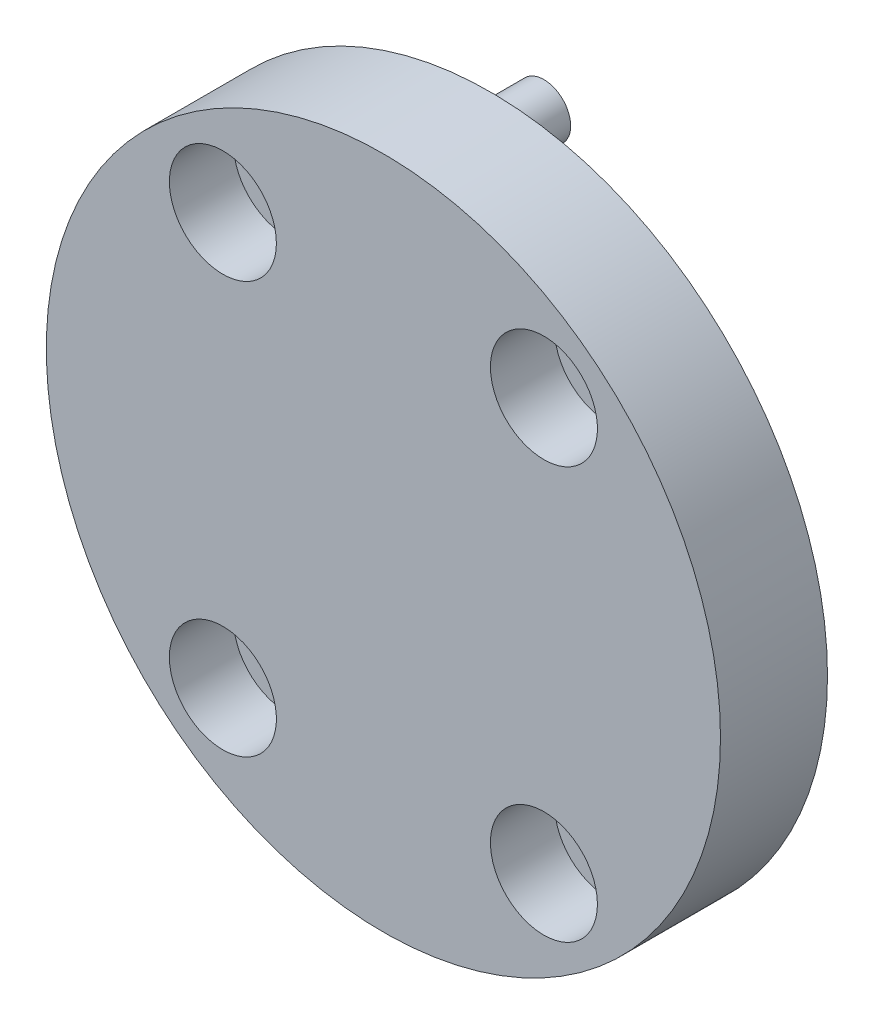
ISO-10303-21;
HEADER;
FILE_DESCRIPTION(('STEP AP214'),'2;1');
FILE_NAME('part.step','',(''),(''),'','','');
FILE_SCHEMA(('AUTOMOTIVE_DESIGN { 1 0 10303 214 1 1 1 1 }'));
ENDSEC;
DATA;
#1=APPLICATION_CONTEXT('core data for automotive mechanical design processes');
#2=APPLICATION_PROTOCOL_DEFINITION('international standard','automotive_design',2000,#1);
#3=PRODUCT_CONTEXT('',#1,'mechanical');
#4=PRODUCT('Part','Part','',(#3));
#5=PRODUCT_RELATED_PRODUCT_CATEGORY('part','',(#4));
#6=PRODUCT_DEFINITION_FORMATION('','',#4);
#7=PRODUCT_DEFINITION_CONTEXT('part definition',#1,'design');
#8=PRODUCT_DEFINITION('design','',#6,#7);
#9=PRODUCT_DEFINITION_SHAPE('','',#8);
#10=(LENGTH_UNIT() NAMED_UNIT(*) SI_UNIT(.MILLI.,.METRE.));
#11=(NAMED_UNIT(*) PLANE_ANGLE_UNIT() SI_UNIT($,.RADIAN.));
#12=(NAMED_UNIT(*) SI_UNIT($,.STERADIAN.) SOLID_ANGLE_UNIT());
#13=UNCERTAINTY_MEASURE_WITH_UNIT(LENGTH_MEASURE(1.E-05),#10,'distance_accuracy_value','');
#14=(GEOMETRIC_REPRESENTATION_CONTEXT(3) GLOBAL_UNCERTAINTY_ASSIGNED_CONTEXT((#13)) GLOBAL_UNIT_ASSIGNED_CONTEXT((#10,
#11,#12)) REPRESENTATION_CONTEXT('',''));
#15=CARTESIAN_POINT('',(0.,0.,0.));
#16=DIRECTION('',(0.,0.,1.));
#17=DIRECTION('',(1.,0.,0.));
#18=AXIS2_PLACEMENT_3D('',#15,#16,#17);
#19=CARTESIAN_POINT('',(0.,0.,5.));
#20=DIRECTION('',(0.,0.,1.));
#21=DIRECTION('',(1.,0.,0.));
#22=AXIS2_PLACEMENT_3D('',#19,#20,#21);
#23=PLANE('',#22);
#24=CARTESIAN_POINT('',(-15.,-19.2426406871192,5.));
#25=DIRECTION('',(0.,0.,-1.));
#26=DIRECTION('',(-1.,0.,0.));
#27=AXIS2_PLACEMENT_3D('',#24,#25,#26);
#28=CIRCLE('',#27,4.99999999999999);
#29=CARTESIAN_POINT('',(-20.,-19.2426406871192,5.));
#30=VERTEX_POINT('',#29);
#31=EDGE_CURVE('E203',#30,#30,#28,.T.);
#32=ORIENTED_EDGE('',*,*,#31,.T.);
#33=EDGE_LOOP('',(#32));
#34=FACE_BOUND('',#33,.T.);
#35=CARTESIAN_POINT('',(15.,-19.2426406871192,5.));
#36=DIRECTION('',(0.,0.,1.));
#37=DIRECTION('',(1.,0.,0.));
#38=AXIS2_PLACEMENT_3D('',#35,#36,#37);
#39=CIRCLE('',#38,4.99999999999999);
#40=CARTESIAN_POINT('',(20.,-19.2426406871192,5.));
#41=VERTEX_POINT('',#40);
#42=EDGE_CURVE('E214',#41,#41,#39,.T.);
#43=ORIENTED_EDGE('',*,*,#42,.F.);
#44=EDGE_LOOP('',(#43));
#45=FACE_BOUND('',#44,.T.);
#46=CARTESIAN_POINT('',(-15.,19.2426406871192,5.));
#47=DIRECTION('',(0.,0.,1.));
#48=DIRECTION('',(1.,0.,0.));
#49=AXIS2_PLACEMENT_3D('',#46,#47,#48);
#50=CIRCLE('',#49,5.);
#51=CARTESIAN_POINT('',(-10.,19.2426406871192,5.));
#52=VERTEX_POINT('',#51);
#53=EDGE_CURVE('E87',#52,#52,#50,.T.);
#54=ORIENTED_EDGE('',*,*,#53,.F.);
#55=EDGE_LOOP('',(#54));
#56=FACE_BOUND('',#55,.T.);
#57=CARTESIAN_POINT('',(0.,0.,5.));
#58=DIRECTION('',(0.,0.,1.));
#59=DIRECTION('',(1.,0.,0.));
#60=AXIS2_PLACEMENT_3D('',#57,#58,#59);
#61=CIRCLE('',#60,31.5);
#62=CARTESIAN_POINT('',(31.5,0.,5.));
#63=VERTEX_POINT('',#62);
#64=EDGE_CURVE('E10',#63,#63,#61,.T.);
#65=ORIENTED_EDGE('',*,*,#64,.T.);
#66=EDGE_LOOP('',(#65));
#67=FACE_BOUND('',#66,.T.);
#68=CARTESIAN_POINT('',(15.,19.2426406871192,5.));
#69=DIRECTION('',(0.,0.,-1.));
#70=DIRECTION('',(-1.,0.,0.));
#71=AXIS2_PLACEMENT_3D('',#68,#69,#70);
#72=CIRCLE('',#71,5.);
#73=CARTESIAN_POINT('',(10.,19.2426406871192,5.));
#74=VERTEX_POINT('',#73);
#75=EDGE_CURVE('E196',#74,#74,#72,.T.);
#76=ORIENTED_EDGE('',*,*,#75,.T.);
#77=EDGE_LOOP('',(#76));
#78=FACE_BOUND('',#77,.T.);
#79=ADVANCED_FACE('F37',(#34,#45,#56,#67,#78),#23,.T.);
#80=CARTESIAN_POINT('',(-15.,19.2426406871192,-5.));
#81=DIRECTION('',(0.,0.,1.));
#82=DIRECTION('',(1.,0.,0.));
#83=AXIS2_PLACEMENT_3D('',#80,#81,#82);
#84=CYLINDRICAL_SURFACE('',#83,3.);
#85=CARTESIAN_POINT('',(-15.,19.2426406871192,-5.));
#86=DIRECTION('',(0.,0.,1.));
#87=DIRECTION('',(1.,0.,0.));
#88=AXIS2_PLACEMENT_3D('',#85,#86,#87);
#89=CIRCLE('',#88,3.);
#90=CARTESIAN_POINT('',(-12.,19.2426406871192,-5.));
#91=VERTEX_POINT('',#90);
#92=EDGE_CURVE('E89',#91,#91,#89,.T.);
#93=ORIENTED_EDGE('',*,*,#92,.F.);
#94=EDGE_LOOP('',(#93));
#95=FACE_BOUND('',#94,.T.);
#96=CARTESIAN_POINT('',(-15.,19.2426406871192,-1.));
#97=DIRECTION('',(0.,0.,1.));
#98=DIRECTION('',(1.,0.,0.));
#99=AXIS2_PLACEMENT_3D('',#96,#97,#98);
#100=CIRCLE('',#99,3.);
#101=CARTESIAN_POINT('',(-12.,19.2426406871192,-1.));
#102=VERTEX_POINT('',#101);
#103=EDGE_CURVE('E71',#102,#102,#100,.F.);
#104=ORIENTED_EDGE('',*,*,#103,.F.);
#105=EDGE_LOOP('',(#104));
#106=FACE_BOUND('',#105,.T.);
#107=ADVANCED_FACE('F105',(#95,#106),#84,.F.);
#108=CARTESIAN_POINT('',(15.,-19.2426406871192,-5.));
#109=DIRECTION('',(0.,0.,1.));
#110=DIRECTION('',(1.,0.,0.));
#111=AXIS2_PLACEMENT_3D('',#108,#109,#110);
#112=CYLINDRICAL_SURFACE('',#111,3.);
#113=CARTESIAN_POINT('',(15.,-19.2426406871192,-5.));
#114=DIRECTION('',(0.,0.,1.));
#115=DIRECTION('',(1.,0.,0.));
#116=AXIS2_PLACEMENT_3D('',#113,#114,#115);
#117=CIRCLE('',#116,3.);
#118=CARTESIAN_POINT('',(18.,-19.2426406871192,-5.));
#119=VERTEX_POINT('',#118);
#120=EDGE_CURVE('E61',#119,#119,#117,.T.);
#121=ORIENTED_EDGE('',*,*,#120,.F.);
#122=EDGE_LOOP('',(#121));
#123=FACE_BOUND('',#122,.T.);
#124=CARTESIAN_POINT('',(15.,-19.2426406871192,-1.));
#125=DIRECTION('',(0.,0.,1.));
#126=DIRECTION('',(1.,0.,0.));
#127=AXIS2_PLACEMENT_3D('',#124,#125,#126);
#128=CIRCLE('',#127,3.);
#129=CARTESIAN_POINT('',(18.,-19.2426406871192,-1.));
#130=VERTEX_POINT('',#129);
#131=EDGE_CURVE('E63',#130,#130,#128,.F.);
#132=ORIENTED_EDGE('',*,*,#131,.F.);
#133=EDGE_LOOP('',(#132));
#134=FACE_BOUND('',#133,.T.);
#135=ADVANCED_FACE('F102',(#123,#134),#112,.F.);
#136=CARTESIAN_POINT('',(0.,0.,-5.));
#137=DIRECTION('',(0.,0.,1.));
#138=DIRECTION('',(1.,0.,0.));
#139=AXIS2_PLACEMENT_3D('',#136,#137,#138);
#140=PLANE('',#139);
#141=CARTESIAN_POINT('',(0.,27.5,-5.));
#142=DIRECTION('',(0.,0.,1.));
#143=DIRECTION('',(1.,0.,0.));
#144=AXIS2_PLACEMENT_3D('',#141,#142,#143);
#145=CIRCLE('',#144,2.5);
#146=CARTESIAN_POINT('',(2.5,27.5,-5.));
#147=VERTEX_POINT('',#146);
#148=EDGE_CURVE('E57',#147,#147,#145,.T.);
#149=ORIENTED_EDGE('',*,*,#148,.T.);
#150=EDGE_LOOP('',(#149));
#151=FACE_BOUND('',#150,.T.);
#152=ORIENTED_EDGE('',*,*,#92,.T.);
#153=EDGE_LOOP('',(#152));
#154=FACE_BOUND('',#153,.T.);
#155=CARTESIAN_POINT('',(15.,19.2426406871192,-5.));
#156=DIRECTION('',(0.,0.,-1.));
#157=DIRECTION('',(-1.,0.,0.));
#158=AXIS2_PLACEMENT_3D('',#155,#156,#157);
#159=CIRCLE('',#158,3.);
#160=CARTESIAN_POINT('',(12.,19.2426406871192,-5.));
#161=VERTEX_POINT('',#160);
#162=EDGE_CURVE('E52',#161,#161,#159,.T.);
#163=ORIENTED_EDGE('',*,*,#162,.F.);
#164=EDGE_LOOP('',(#163));
#165=FACE_BOUND('',#164,.T.);
#166=CARTESIAN_POINT('',(0.,0.,-5.));
#167=DIRECTION('',(0.,0.,1.));
#168=DIRECTION('',(1.,0.,0.));
#169=AXIS2_PLACEMENT_3D('',#166,#167,#168);
#170=CIRCLE('',#169,31.5);
#171=CARTESIAN_POINT('',(31.5,0.,-5.));
#172=VERTEX_POINT('',#171);
#173=EDGE_CURVE('E46',#172,#172,#170,.T.);
#174=ORIENTED_EDGE('',*,*,#173,.F.);
#175=EDGE_LOOP('',(#174));
#176=FACE_BOUND('',#175,.T.);
#177=CARTESIAN_POINT('',(-15.,-19.2426406871192,-5.));
#178=DIRECTION('',(0.,0.,-1.));
#179=DIRECTION('',(-1.,0.,0.));
#180=AXIS2_PLACEMENT_3D('',#177,#178,#179);
#181=CIRCLE('',#180,3.);
#182=CARTESIAN_POINT('',(-18.,-19.2426406871192,-5.));
#183=VERTEX_POINT('',#182);
#184=EDGE_CURVE('E93',#183,#183,#181,.T.);
#185=ORIENTED_EDGE('',*,*,#184,.F.);
#186=EDGE_LOOP('',(#185));
#187=FACE_BOUND('',#186,.T.);
#188=ORIENTED_EDGE('',*,*,#120,.T.);
#189=EDGE_LOOP('',(#188));
#190=FACE_BOUND('',#189,.T.);
#191=ADVANCED_FACE('F100',(#151,#154,#165,#176,#187,#190),#140,.F.);
#192=CARTESIAN_POINT('',(0.,0.,5.));
#193=DIRECTION('',(0.,0.,-1.));
#194=DIRECTION('',(-1.,0.,0.));
#195=AXIS2_PLACEMENT_3D('',#192,#193,#194);
#196=CYLINDRICAL_SURFACE('',#195,31.5);
#197=ORIENTED_EDGE('',*,*,#64,.F.);
#198=EDGE_LOOP('',(#197));
#199=FACE_BOUND('',#198,.T.);
#200=ORIENTED_EDGE('',*,*,#173,.T.);
#201=EDGE_LOOP('',(#200));
#202=FACE_BOUND('',#201,.T.);
#203=ADVANCED_FACE('F39',(#199,#202),#196,.T.);
#204=CARTESIAN_POINT('',(15.,19.2426406871192,-5.));
#205=DIRECTION('',(0.,0.,1.));
#206=DIRECTION('',(1.,0.,0.));
#207=AXIS2_PLACEMENT_3D('',#204,#205,#206);
#208=CYLINDRICAL_SURFACE('',#207,3.);
#209=CARTESIAN_POINT('',(15.,19.2426406871192,-1.));
#210=DIRECTION('',(0.,0.,-1.));
#211=DIRECTION('',(-1.,0.,0.));
#212=AXIS2_PLACEMENT_3D('',#209,#210,#211);
#213=CIRCLE('',#212,3.);
#214=CARTESIAN_POINT('',(12.,19.2426406871192,-1.));
#215=VERTEX_POINT('',#214);
#216=EDGE_CURVE('E41',#215,#215,#213,.T.);
#217=ORIENTED_EDGE('',*,*,#216,.F.);
#218=EDGE_LOOP('',(#217));
#219=FACE_BOUND('',#218,.T.);
#220=ORIENTED_EDGE('',*,*,#162,.T.);
#221=EDGE_LOOP('',(#220));
#222=FACE_BOUND('',#221,.T.);
#223=ADVANCED_FACE('F138',(#219,#222),#208,.F.);
#224=CARTESIAN_POINT('',(-15.,-19.2426406871192,-5.));
#225=DIRECTION('',(0.,0.,1.));
#226=DIRECTION('',(1.,0.,0.));
#227=AXIS2_PLACEMENT_3D('',#224,#225,#226);
#228=CYLINDRICAL_SURFACE('',#227,3.);
#229=CARTESIAN_POINT('',(-15.,-19.2426406871192,-1.));
#230=DIRECTION('',(0.,0.,-1.));
#231=DIRECTION('',(-1.,0.,0.));
#232=AXIS2_PLACEMENT_3D('',#229,#230,#231);
#233=CIRCLE('',#232,3.);
#234=CARTESIAN_POINT('',(-18.,-19.2426406871192,-1.));
#235=VERTEX_POINT('',#234);
#236=EDGE_CURVE('E67',#235,#235,#233,.T.);
#237=ORIENTED_EDGE('',*,*,#236,.F.);
#238=EDGE_LOOP('',(#237));
#239=FACE_BOUND('',#238,.T.);
#240=ORIENTED_EDGE('',*,*,#184,.T.);
#241=EDGE_LOOP('',(#240));
#242=FACE_BOUND('',#241,.T.);
#243=ADVANCED_FACE('F156',(#239,#242),#228,.F.);
#244=CARTESIAN_POINT('',(0.,27.5,-10.));
#245=DIRECTION('',(0.,0.,1.));
#246=DIRECTION('',(1.,0.,0.));
#247=AXIS2_PLACEMENT_3D('',#244,#245,#246);
#248=CYLINDRICAL_SURFACE('',#247,2.5);
#249=CARTESIAN_POINT('',(0.,27.5,-10.));
#250=DIRECTION('',(0.,0.,1.));
#251=DIRECTION('',(1.,0.,0.));
#252=AXIS2_PLACEMENT_3D('',#249,#250,#251);
#253=CIRCLE('',#252,2.5);
#254=CARTESIAN_POINT('',(2.5,27.5,-10.));
#255=VERTEX_POINT('',#254);
#256=EDGE_CURVE('E62',#255,#255,#253,.T.);
#257=ORIENTED_EDGE('',*,*,#256,.T.);
#258=EDGE_LOOP('',(#257));
#259=FACE_BOUND('',#258,.T.);
#260=ORIENTED_EDGE('',*,*,#148,.F.);
#261=EDGE_LOOP('',(#260));
#262=FACE_BOUND('',#261,.T.);
#263=ADVANCED_FACE('F122',(#259,#262),#248,.T.);
#264=CARTESIAN_POINT('',(0.,27.5,-10.));
#265=DIRECTION('',(0.,0.,1.));
#266=DIRECTION('',(1.,0.,0.));
#267=AXIS2_PLACEMENT_3D('',#264,#265,#266);
#268=PLANE('',#267);
#269=ORIENTED_EDGE('',*,*,#256,.F.);
#270=EDGE_LOOP('',(#269));
#271=FACE_BOUND('',#270,.T.);
#272=ADVANCED_FACE('F112',(#271),#268,.F.);
#273=CARTESIAN_POINT('',(15.,-19.2426406871192,-1.));
#274=DIRECTION('',(0.,0.,1.));
#275=DIRECTION('',(1.,0.,0.));
#276=AXIS2_PLACEMENT_3D('',#273,#274,#275);
#277=PLANE('',#276);
#278=CARTESIAN_POINT('',(15.,-19.2426406871192,-1.));
#279=DIRECTION('',(0.,0.,1.));
#280=DIRECTION('',(1.,0.,0.));
#281=AXIS2_PLACEMENT_3D('',#278,#279,#280);
#282=CIRCLE('',#281,4.99999999999999);
#283=CARTESIAN_POINT('',(20.,-19.2426406871192,-1.));
#284=VERTEX_POINT('',#283);
#285=EDGE_CURVE('E206',#284,#284,#282,.T.);
#286=ORIENTED_EDGE('',*,*,#285,.T.);
#287=EDGE_LOOP('',(#286));
#288=FACE_BOUND('',#287,.T.);
#289=ORIENTED_EDGE('',*,*,#131,.T.);
#290=EDGE_LOOP('',(#289));
#291=FACE_BOUND('',#290,.T.);
#292=ADVANCED_FACE('F109',(#288,#291),#277,.T.);
#293=CARTESIAN_POINT('',(15.,-19.2426406871192,-1.));
#294=DIRECTION('',(0.,0.,1.));
#295=DIRECTION('',(1.,0.,0.));
#296=AXIS2_PLACEMENT_3D('',#293,#294,#295);
#297=CYLINDRICAL_SURFACE('',#296,4.99999999999999);
#298=ORIENTED_EDGE('',*,*,#285,.F.);
#299=EDGE_LOOP('',(#298));
#300=FACE_BOUND('',#299,.T.);
#301=ORIENTED_EDGE('',*,*,#42,.T.);
#302=EDGE_LOOP('',(#301));
#303=FACE_BOUND('',#302,.T.);
#304=ADVANCED_FACE('F111',(#300,#303),#297,.F.);
#305=CARTESIAN_POINT('',(-15.,-19.2426406871192,-1.));
#306=DIRECTION('',(0.,0.,1.));
#307=DIRECTION('',(1.,0.,0.));
#308=AXIS2_PLACEMENT_3D('',#305,#306,#307);
#309=CYLINDRICAL_SURFACE('',#308,4.99999999999999);
#310=CARTESIAN_POINT('',(-15.,-19.2426406871192,-1.));
#311=DIRECTION('',(0.,0.,-1.));
#312=DIRECTION('',(-1.,0.,0.));
#313=AXIS2_PLACEMENT_3D('',#310,#311,#312);
#314=CIRCLE('',#313,4.99999999999999);
#315=CARTESIAN_POINT('',(-20.,-19.2426406871192,-1.));
#316=VERTEX_POINT('',#315);
#317=EDGE_CURVE('E211',#316,#316,#314,.T.);
#318=ORIENTED_EDGE('',*,*,#317,.T.);
#319=EDGE_LOOP('',(#318));
#320=FACE_BOUND('',#319,.T.);
#321=ORIENTED_EDGE('',*,*,#31,.F.);
#322=EDGE_LOOP('',(#321));
#323=FACE_BOUND('',#322,.T.);
#324=ADVANCED_FACE('F119',(#320,#323),#309,.F.);
#325=CARTESIAN_POINT('',(-15.,-19.2426406871192,-1.));
#326=DIRECTION('',(0.,0.,-1.));
#327=DIRECTION('',(-1.,0.,0.));
#328=AXIS2_PLACEMENT_3D('',#325,#326,#327);
#329=PLANE('',#328);
#330=ORIENTED_EDGE('',*,*,#236,.T.);
#331=EDGE_LOOP('',(#330));
#332=FACE_BOUND('',#331,.T.);
#333=ORIENTED_EDGE('',*,*,#317,.F.);
#334=EDGE_LOOP('',(#333));
#335=FACE_BOUND('',#334,.T.);
#336=ADVANCED_FACE('F176',(#332,#335),#329,.F.);
#337=CARTESIAN_POINT('',(-15.,19.2426406871192,-1.));
#338=DIRECTION('',(0.,0.,1.));
#339=DIRECTION('',(1.,0.,0.));
#340=AXIS2_PLACEMENT_3D('',#337,#338,#339);
#341=PLANE('',#340);
#342=CARTESIAN_POINT('',(-15.,19.2426406871192,-1.));
#343=DIRECTION('',(0.,0.,1.));
#344=DIRECTION('',(1.,0.,0.));
#345=AXIS2_PLACEMENT_3D('',#342,#343,#344);
#346=CIRCLE('',#345,5.);
#347=CARTESIAN_POINT('',(-10.,19.2426406871192,-1.));
#348=VERTEX_POINT('',#347);
#349=EDGE_CURVE('E68',#348,#348,#346,.T.);
#350=ORIENTED_EDGE('',*,*,#349,.T.);
#351=EDGE_LOOP('',(#350));
#352=FACE_BOUND('',#351,.T.);
#353=ORIENTED_EDGE('',*,*,#103,.T.);
#354=EDGE_LOOP('',(#353));
#355=FACE_BOUND('',#354,.T.);
#356=ADVANCED_FACE('F172',(#352,#355),#341,.T.);
#357=CARTESIAN_POINT('',(-15.,19.2426406871192,-1.));
#358=DIRECTION('',(0.,0.,1.));
#359=DIRECTION('',(1.,0.,0.));
#360=AXIS2_PLACEMENT_3D('',#357,#358,#359);
#361=CYLINDRICAL_SURFACE('',#360,5.);
#362=ORIENTED_EDGE('',*,*,#349,.F.);
#363=EDGE_LOOP('',(#362));
#364=FACE_BOUND('',#363,.T.);
#365=ORIENTED_EDGE('',*,*,#53,.T.);
#366=EDGE_LOOP('',(#365));
#367=FACE_BOUND('',#366,.T.);
#368=ADVANCED_FACE('F168',(#364,#367),#361,.F.);
#369=CARTESIAN_POINT('',(15.,19.2426406871192,-1.));
#370=DIRECTION('',(0.,0.,1.));
#371=DIRECTION('',(1.,0.,0.));
#372=AXIS2_PLACEMENT_3D('',#369,#370,#371);
#373=CYLINDRICAL_SURFACE('',#372,5.);
#374=CARTESIAN_POINT('',(15.,19.2426406871192,-1.));
#375=DIRECTION('',(0.,0.,-1.));
#376=DIRECTION('',(-1.,0.,0.));
#377=AXIS2_PLACEMENT_3D('',#374,#375,#376);
#378=CIRCLE('',#377,5.);
#379=CARTESIAN_POINT('',(10.,19.2426406871192,-1.));
#380=VERTEX_POINT('',#379);
#381=EDGE_CURVE('E193',#380,#380,#378,.T.);
#382=ORIENTED_EDGE('',*,*,#381,.T.);
#383=EDGE_LOOP('',(#382));
#384=FACE_BOUND('',#383,.T.);
#385=ORIENTED_EDGE('',*,*,#75,.F.);
#386=EDGE_LOOP('',(#385));
#387=FACE_BOUND('',#386,.T.);
#388=ADVANCED_FACE('F171',(#384,#387),#373,.F.);
#389=CARTESIAN_POINT('',(15.,19.2426406871192,-1.));
#390=DIRECTION('',(0.,0.,-1.));
#391=DIRECTION('',(-1.,0.,0.));
#392=AXIS2_PLACEMENT_3D('',#389,#390,#391);
#393=PLANE('',#392);
#394=ORIENTED_EDGE('',*,*,#216,.T.);
#395=EDGE_LOOP('',(#394));
#396=FACE_BOUND('',#395,.T.);
#397=ORIENTED_EDGE('',*,*,#381,.F.);
#398=EDGE_LOOP('',(#397));
#399=FACE_BOUND('',#398,.T.);
#400=ADVANCED_FACE('F184',(#396,#399),#393,.F.);
#401=CLOSED_SHELL('',(#79,#107,#135,#191,#203,#223,#243,#263,#272,#292,#304,#324,#336,#356,#368,
#388,#400));
#402=MANIFOLD_SOLID_BREP('B2',#401);
#403=ADVANCED_BREP_SHAPE_REPRESENTATION('',(#18,#402),#14);
#404=SHAPE_DEFINITION_REPRESENTATION(#9,#403);
ENDSEC;
END-ISO-10303-21;
